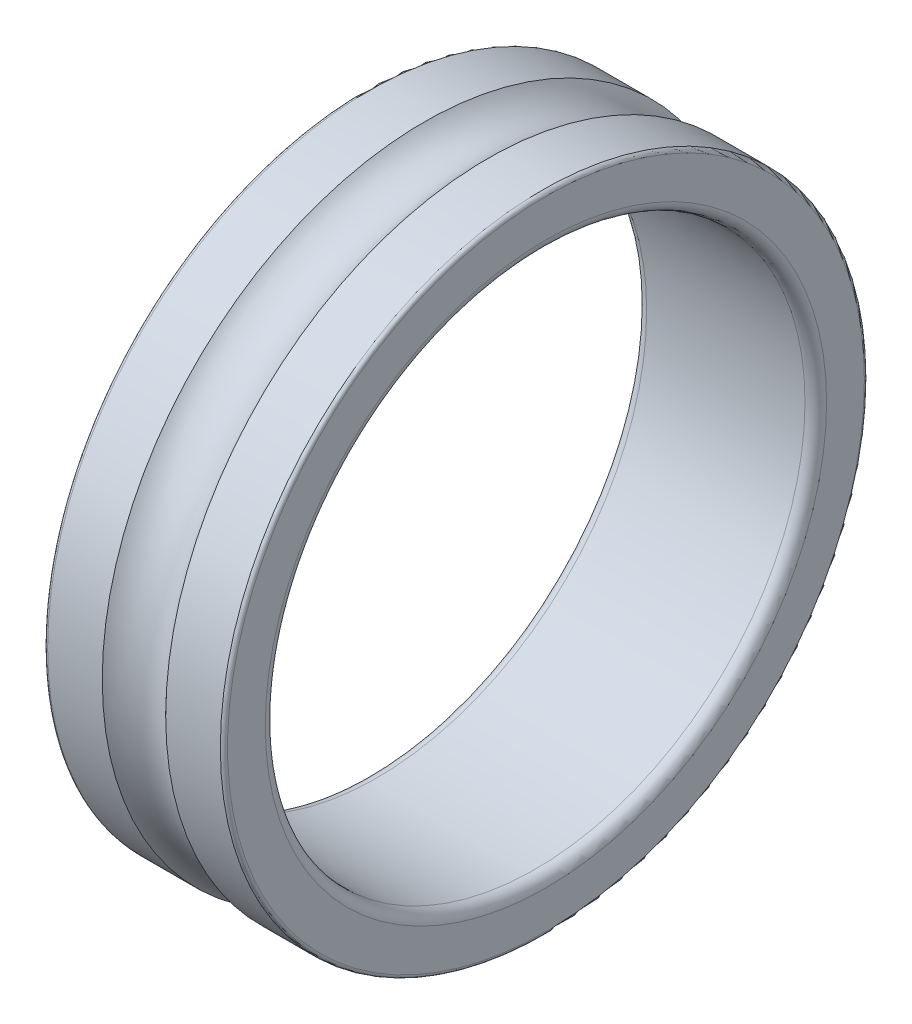
ISO-10303-21;
HEADER;
FILE_DESCRIPTION(('STEP AP214'),'2;1');
FILE_NAME('part.step','',(''),(''),'','','');
FILE_SCHEMA(('AUTOMOTIVE_DESIGN { 1 0 10303 214 1 1 1 1 }'));
ENDSEC;
DATA;
#1=APPLICATION_CONTEXT('core data for automotive mechanical design processes');
#2=APPLICATION_PROTOCOL_DEFINITION('international standard','automotive_design',2000,#1);
#3=PRODUCT_CONTEXT('',#1,'mechanical');
#4=PRODUCT('Part','Part','',(#3));
#5=PRODUCT_RELATED_PRODUCT_CATEGORY('part','',(#4));
#6=PRODUCT_DEFINITION_FORMATION('','',#4);
#7=PRODUCT_DEFINITION_CONTEXT('part definition',#1,'design');
#8=PRODUCT_DEFINITION('design','',#6,#7);
#9=PRODUCT_DEFINITION_SHAPE('','',#8);
#10=(LENGTH_UNIT() NAMED_UNIT(*) SI_UNIT(.MILLI.,.METRE.));
#11=(NAMED_UNIT(*) PLANE_ANGLE_UNIT() SI_UNIT($,.RADIAN.));
#12=(NAMED_UNIT(*) SI_UNIT($,.STERADIAN.) SOLID_ANGLE_UNIT());
#13=UNCERTAINTY_MEASURE_WITH_UNIT(LENGTH_MEASURE(1.E-05),#10,'distance_accuracy_value','');
#14=(GEOMETRIC_REPRESENTATION_CONTEXT(3) GLOBAL_UNCERTAINTY_ASSIGNED_CONTEXT((#13)) GLOBAL_UNIT_ASSIGNED_CONTEXT((#10,
#11,#12)) REPRESENTATION_CONTEXT('',''));
#15=CARTESIAN_POINT('',(0.,0.,0.));
#16=DIRECTION('',(0.,0.,1.));
#17=DIRECTION('',(1.,0.,0.));
#18=AXIS2_PLACEMENT_3D('',#15,#16,#17);
#19=CARTESIAN_POINT('',(0.299999999999941,0.,0.));
#20=DIRECTION('',(1.,0.,0.));
#21=DIRECTION('',(0.,0.,-1.));
#22=AXIS2_PLACEMENT_3D('',#19,#20,#21);
#23=TOROIDAL_SURFACE('',#22,7.79999999999994,0.299999999999941);
#24=CARTESIAN_POINT('',(0.3,0.,0.));
#25=DIRECTION('',(1.,0.,0.));
#26=DIRECTION('',(0.,0.,-1.));
#27=AXIS2_PLACEMENT_3D('',#24,#25,#26);
#28=CIRCLE('',#27,7.5);
#29=CARTESIAN_POINT('',(0.3,0.,-7.5));
#30=VERTEX_POINT('',#29);
#31=EDGE_CURVE('E10',#30,#30,#28,.T.);
#32=ORIENTED_EDGE('',*,*,#31,.T.);
#33=EDGE_LOOP('',(#32));
#34=FACE_BOUND('',#33,.T.);
#35=CARTESIAN_POINT('',(0.,0.,0.));
#36=DIRECTION('',(1.,0.,0.));
#37=DIRECTION('',(0.,0.,-1.));
#38=AXIS2_PLACEMENT_3D('',#35,#36,#37);
#39=CIRCLE('',#38,7.8);
#40=CARTESIAN_POINT('',(0.,0.,-7.8));
#41=VERTEX_POINT('',#40);
#42=EDGE_CURVE('E70',#41,#41,#39,.T.);
#43=ORIENTED_EDGE('',*,*,#42,.F.);
#44=EDGE_LOOP('',(#43));
#45=FACE_BOUND('',#44,.T.);
#46=ADVANCED_FACE('F36',(#34,#45),#23,.T.);
#47=CARTESIAN_POINT('',(4.7,0.,0.));
#48=DIRECTION('',(1.,0.,0.));
#49=DIRECTION('',(0.,0.,-1.));
#50=AXIS2_PLACEMENT_3D('',#47,#48,#49);
#51=CYLINDRICAL_SURFACE('',#50,7.5);
#52=CARTESIAN_POINT('',(4.7,0.,0.));
#53=DIRECTION('',(1.,0.,0.));
#54=DIRECTION('',(0.,0.,-1.));
#55=AXIS2_PLACEMENT_3D('',#52,#53,#54);
#56=CIRCLE('',#55,7.5);
#57=CARTESIAN_POINT('',(4.7,0.,-7.5));
#58=VERTEX_POINT('',#57);
#59=EDGE_CURVE('E42',#58,#58,#56,.T.);
#60=ORIENTED_EDGE('',*,*,#59,.T.);
#61=EDGE_LOOP('',(#60));
#62=FACE_BOUND('',#61,.T.);
#63=ORIENTED_EDGE('',*,*,#31,.F.);
#64=EDGE_LOOP('',(#63));
#65=FACE_BOUND('',#64,.T.);
#66=ADVANCED_FACE('F78',(#62,#65),#51,.F.);
#67=CARTESIAN_POINT('',(4.70000000000012,0.,0.));
#68=DIRECTION('',(1.,0.,0.));
#69=DIRECTION('',(0.,0.,-1.));
#70=AXIS2_PLACEMENT_3D('',#67,#68,#69);
#71=TOROIDAL_SURFACE('',#70,7.79999999999988,0.29999999999988);
#72=CARTESIAN_POINT('',(5.,0.,0.));
#73=DIRECTION('',(1.,0.,0.));
#74=DIRECTION('',(0.,0.,-1.));
#75=AXIS2_PLACEMENT_3D('',#72,#73,#74);
#76=CIRCLE('',#75,7.8);
#77=CARTESIAN_POINT('',(5.,0.,-7.8));
#78=VERTEX_POINT('',#77);
#79=EDGE_CURVE('E46',#78,#78,#76,.T.);
#80=ORIENTED_EDGE('',*,*,#79,.T.);
#81=EDGE_LOOP('',(#80));
#82=FACE_BOUND('',#81,.T.);
#83=ORIENTED_EDGE('',*,*,#59,.F.);
#84=EDGE_LOOP('',(#83));
#85=FACE_BOUND('',#84,.T.);
#86=ADVANCED_FACE('F82',(#82,#85),#71,.T.);
#87=CARTESIAN_POINT('',(5.,7.8,0.));
#88=DIRECTION('',(1.,0.,0.));
#89=DIRECTION('',(0.,0.,-1.));
#90=AXIS2_PLACEMENT_3D('',#87,#88,#89);
#91=PLANE('',#90);
#92=CARTESIAN_POINT('',(5.,0.,0.));
#93=DIRECTION('',(1.,0.,0.));
#94=DIRECTION('',(0.,0.,-1.));
#95=AXIS2_PLACEMENT_3D('',#92,#93,#94);
#96=CIRCLE('',#95,8.85);
#97=CARTESIAN_POINT('',(5.,0.,-8.85));
#98=VERTEX_POINT('',#97);
#99=EDGE_CURVE('E50',#98,#98,#96,.T.);
#100=ORIENTED_EDGE('',*,*,#99,.T.);
#101=EDGE_LOOP('',(#100));
#102=FACE_BOUND('',#101,.T.);
#103=ORIENTED_EDGE('',*,*,#79,.F.);
#104=EDGE_LOOP('',(#103));
#105=FACE_BOUND('',#104,.T.);
#106=ADVANCED_FACE('F86',(#102,#105),#91,.T.);
#107=CARTESIAN_POINT('',(4.90000000000015,0.,0.));
#108=DIRECTION('',(1.,0.,0.));
#109=DIRECTION('',(0.,0.,-1.));
#110=AXIS2_PLACEMENT_3D('',#107,#108,#109);
#111=TOROIDAL_SURFACE('',#110,8.85000000000015,0.099999999999845);
#112=CARTESIAN_POINT('',(4.9,0.,0.));
#113=DIRECTION('',(1.,0.,0.));
#114=DIRECTION('',(0.,0.,-1.));
#115=AXIS2_PLACEMENT_3D('',#112,#113,#114);
#116=CIRCLE('',#115,8.95);
#117=CARTESIAN_POINT('',(4.9,0.,-8.95));
#118=VERTEX_POINT('',#117);
#119=EDGE_CURVE('E55',#118,#118,#116,.T.);
#120=ORIENTED_EDGE('',*,*,#119,.T.);
#121=EDGE_LOOP('',(#120));
#122=FACE_BOUND('',#121,.T.);
#123=ORIENTED_EDGE('',*,*,#99,.F.);
#124=EDGE_LOOP('',(#123));
#125=FACE_BOUND('',#124,.T.);
#126=ADVANCED_FACE('F93',(#122,#125),#111,.T.);
#127=CARTESIAN_POINT('',(4.7,0.,0.));
#128=DIRECTION('',(1.,0.,0.));
#129=DIRECTION('',(0.,0.,-1.));
#130=AXIS2_PLACEMENT_3D('',#127,#128,#129);
#131=CYLINDRICAL_SURFACE('',#130,8.95);
#132=CARTESIAN_POINT('',(3.3816406580915,0.,0.));
#133=DIRECTION('',(1.,0.,0.));
#134=DIRECTION('',(0.,0.,-1.));
#135=AXIS2_PLACEMENT_3D('',#132,#133,#134);
#136=CIRCLE('',#135,8.95);
#137=CARTESIAN_POINT('',(3.3816406580915,0.,-8.95));
#138=VERTEX_POINT('',#137);
#139=EDGE_CURVE('E58',#138,#138,#136,.T.);
#140=ORIENTED_EDGE('',*,*,#139,.T.);
#141=EDGE_LOOP('',(#140));
#142=FACE_BOUND('',#141,.T.);
#143=ORIENTED_EDGE('',*,*,#119,.F.);
#144=EDGE_LOOP('',(#143));
#145=FACE_BOUND('',#144,.T.);
#146=ADVANCED_FACE('F97',(#142,#145),#131,.T.);
#147=CARTESIAN_POINT('',(2.5,0.,0.));
#148=DIRECTION('',(1.,0.,0.));
#149=DIRECTION('',(0.,0.,-1.));
#150=AXIS2_PLACEMENT_3D('',#147,#148,#149);
#151=TOROIDAL_SURFACE('',#150,9.75000000000002,1.19050000000002);
#152=CARTESIAN_POINT('',(1.6183593419085,0.,0.));
#153=DIRECTION('',(1.,0.,0.));
#154=DIRECTION('',(0.,0.,-1.));
#155=AXIS2_PLACEMENT_3D('',#152,#153,#154);
#156=CIRCLE('',#155,8.95);
#157=CARTESIAN_POINT('',(1.6183593419085,0.,-8.95));
#158=VERTEX_POINT('',#157);
#159=EDGE_CURVE('E61',#158,#158,#156,.T.);
#160=ORIENTED_EDGE('',*,*,#159,.T.);
#161=EDGE_LOOP('',(#160));
#162=FACE_BOUND('',#161,.T.);
#163=ORIENTED_EDGE('',*,*,#139,.F.);
#164=EDGE_LOOP('',(#163));
#165=FACE_BOUND('',#164,.T.);
#166=ADVANCED_FACE('F101',(#162,#165),#151,.F.);
#167=CARTESIAN_POINT('',(4.7,0.,0.));
#168=DIRECTION('',(1.,0.,0.));
#169=DIRECTION('',(0.,0.,-1.));
#170=AXIS2_PLACEMENT_3D('',#167,#168,#169);
#171=CYLINDRICAL_SURFACE('',#170,8.95);
#172=CARTESIAN_POINT('',(0.1,0.,0.));
#173=DIRECTION('',(1.,0.,0.));
#174=DIRECTION('',(0.,0.,-1.));
#175=AXIS2_PLACEMENT_3D('',#172,#173,#174);
#176=CIRCLE('',#175,8.95);
#177=CARTESIAN_POINT('',(0.1,0.,-8.95));
#178=VERTEX_POINT('',#177);
#179=EDGE_CURVE('E64',#178,#178,#176,.T.);
#180=ORIENTED_EDGE('',*,*,#179,.T.);
#181=EDGE_LOOP('',(#180));
#182=FACE_BOUND('',#181,.T.);
#183=ORIENTED_EDGE('',*,*,#159,.F.);
#184=EDGE_LOOP('',(#183));
#185=FACE_BOUND('',#184,.T.);
#186=ADVANCED_FACE('F105',(#182,#185),#171,.T.);
#187=CARTESIAN_POINT('',(0.0999999999999208,0.,0.));
#188=DIRECTION('',(1.,0.,0.));
#189=DIRECTION('',(0.,0.,-1.));
#190=AXIS2_PLACEMENT_3D('',#187,#188,#189);
#191=TOROIDAL_SURFACE('',#190,8.85000000000008,0.0999999999999211);
#192=CARTESIAN_POINT('',(0.,0.,0.));
#193=DIRECTION('',(1.,0.,0.));
#194=DIRECTION('',(0.,0.,-1.));
#195=AXIS2_PLACEMENT_3D('',#192,#193,#194);
#196=CIRCLE('',#195,8.85);
#197=CARTESIAN_POINT('',(0.,0.,-8.85));
#198=VERTEX_POINT('',#197);
#199=EDGE_CURVE('E67',#198,#198,#196,.T.);
#200=ORIENTED_EDGE('',*,*,#199,.T.);
#201=EDGE_LOOP('',(#200));
#202=FACE_BOUND('',#201,.T.);
#203=ORIENTED_EDGE('',*,*,#179,.F.);
#204=EDGE_LOOP('',(#203));
#205=FACE_BOUND('',#204,.T.);
#206=ADVANCED_FACE('F109',(#202,#205),#191,.T.);
#207=CARTESIAN_POINT('',(0.,8.85,0.));
#208=DIRECTION('',(-1.,0.,0.));
#209=DIRECTION('',(0.,0.,1.));
#210=AXIS2_PLACEMENT_3D('',#207,#208,#209);
#211=PLANE('',#210);
#212=ORIENTED_EDGE('',*,*,#42,.T.);
#213=EDGE_LOOP('',(#212));
#214=FACE_BOUND('',#213,.T.);
#215=ORIENTED_EDGE('',*,*,#199,.F.);
#216=EDGE_LOOP('',(#215));
#217=FACE_BOUND('',#216,.T.);
#218=ADVANCED_FACE('F74',(#214,#217),#211,.T.);
#219=CLOSED_SHELL('',(#46,#66,#86,#106,#126,#146,#166,#186,#206,#218));
#220=MANIFOLD_SOLID_BREP('B2',#219);
#221=ADVANCED_BREP_SHAPE_REPRESENTATION('',(#18,#220),#14);
#222=SHAPE_DEFINITION_REPRESENTATION(#9,#221);
ENDSEC;
END-ISO-10303-21;
